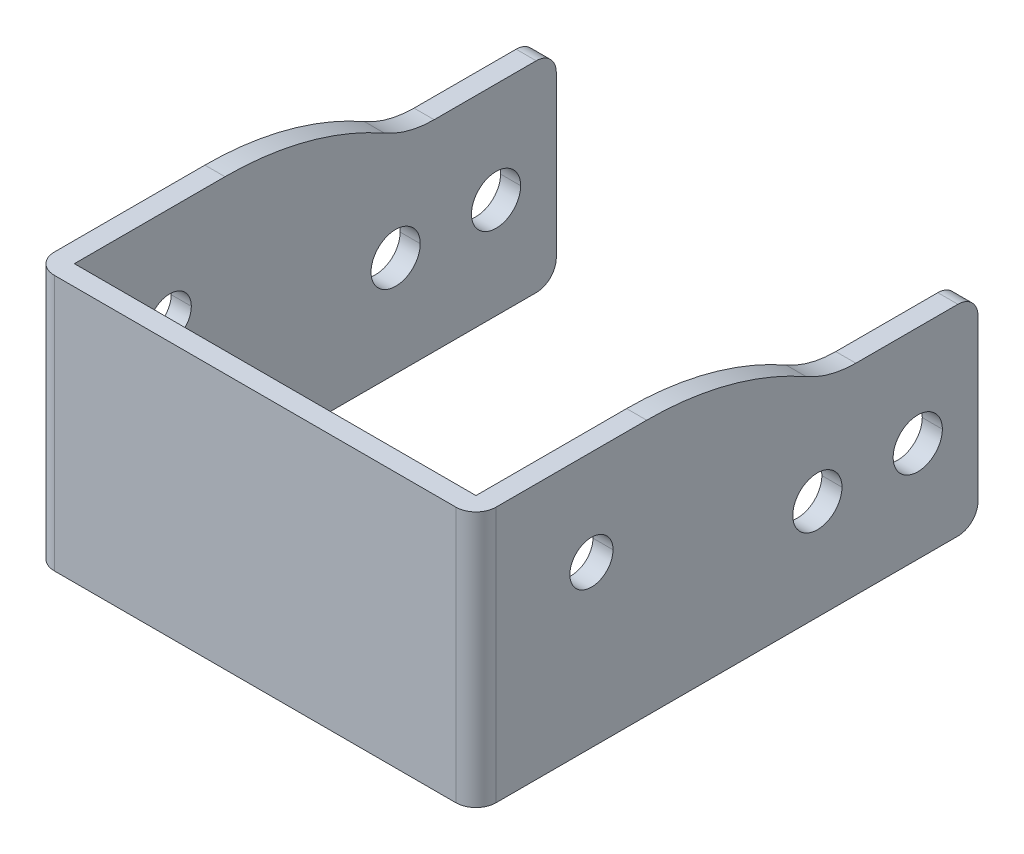
ISO-10303-21;
HEADER;
FILE_DESCRIPTION(('STEP AP214'),'2;1');
FILE_NAME('part.step','',(''),(''),'','','');
FILE_SCHEMA(('AUTOMOTIVE_DESIGN { 1 0 10303 214 1 1 1 1 }'));
ENDSEC;
DATA;
#1=APPLICATION_CONTEXT('core data for automotive mechanical design processes');
#2=APPLICATION_PROTOCOL_DEFINITION('international standard','automotive_design',2000,#1);
#3=PRODUCT_CONTEXT('',#1,'mechanical');
#4=PRODUCT('Part','Part','',(#3));
#5=PRODUCT_RELATED_PRODUCT_CATEGORY('part','',(#4));
#6=PRODUCT_DEFINITION_FORMATION('','',#4);
#7=PRODUCT_DEFINITION_CONTEXT('part definition',#1,'design');
#8=PRODUCT_DEFINITION('design','',#6,#7);
#9=PRODUCT_DEFINITION_SHAPE('','',#8);
#10=(LENGTH_UNIT() NAMED_UNIT(*) SI_UNIT(.MILLI.,.METRE.));
#11=(NAMED_UNIT(*) PLANE_ANGLE_UNIT() SI_UNIT($,.RADIAN.));
#12=(NAMED_UNIT(*) SI_UNIT($,.STERADIAN.) SOLID_ANGLE_UNIT());
#13=UNCERTAINTY_MEASURE_WITH_UNIT(LENGTH_MEASURE(1.E-05),#10,'distance_accuracy_value','');
#14=(GEOMETRIC_REPRESENTATION_CONTEXT(3) GLOBAL_UNCERTAINTY_ASSIGNED_CONTEXT((#13)) GLOBAL_UNIT_ASSIGNED_CONTEXT((#10,
#11,#12)) REPRESENTATION_CONTEXT('',''));
#15=CARTESIAN_POINT('',(0.,0.,0.));
#16=DIRECTION('',(0.,0.,1.));
#17=DIRECTION('',(1.,0.,0.));
#18=AXIS2_PLACEMENT_3D('',#15,#16,#17);
#19=CARTESIAN_POINT('',(-22.,18.,-48.));
#20=DIRECTION('',(1.,0.,0.));
#21=DIRECTION('',(0.,0.,-1.));
#22=AXIS2_PLACEMENT_3D('',#19,#20,#21);
#23=CYLINDRICAL_SURFACE('',#22,2.);
#24=CARTESIAN_POINT('',(-22.,18.,-48.));
#25=DIRECTION('',(-1.,0.,0.));
#26=DIRECTION('',(0.,0.,-1.));
#27=AXIS2_PLACEMENT_3D('',#24,#25,#26);
#28=CIRCLE('',#27,2.);
#29=CARTESIAN_POINT('',(-22.,20.,-48.));
#30=VERTEX_POINT('',#29);
#31=CARTESIAN_POINT('',(-22.,18.,-50.));
#32=VERTEX_POINT('',#31);
#33=EDGE_CURVE('E350',#30,#32,#28,.T.);
#34=ORIENTED_EDGE('',*,*,#33,.F.);
#35=DIRECTION('',(-1.,0.,0.));
#36=VECTOR('',#35,1.);
#37=CARTESIAN_POINT('',(-22.,20.,-48.));
#38=LINE('',#37,#36);
#39=CARTESIAN_POINT('',(-20.,20.,-48.));
#40=VERTEX_POINT('',#39);
#41=EDGE_CURVE('E39',#40,#30,#38,.T.);
#42=ORIENTED_EDGE('',*,*,#41,.F.);
#43=CARTESIAN_POINT('',(-20.,18.,-48.));
#44=DIRECTION('',(1.,0.,0.));
#45=DIRECTION('',(0.,0.,1.));
#46=AXIS2_PLACEMENT_3D('',#43,#44,#45);
#47=CIRCLE('',#46,2.);
#48=CARTESIAN_POINT('',(-20.,18.,-50.));
#49=VERTEX_POINT('',#48);
#50=EDGE_CURVE('E433',#49,#40,#47,.T.);
#51=ORIENTED_EDGE('',*,*,#50,.F.);
#52=DIRECTION('',(1.,0.,0.));
#53=VECTOR('',#52,1.);
#54=CARTESIAN_POINT('',(-22.,18.,-50.));
#55=LINE('',#54,#53);
#56=EDGE_CURVE('E334',#32,#49,#55,.T.);
#57=ORIENTED_EDGE('',*,*,#56,.F.);
#58=EDGE_LOOP('',(#34,#42,#51,#57));
#59=FACE_BOUND('',#58,.T.);
#60=ADVANCED_FACE('F17',(#59),#23,.T.);
#61=CARTESIAN_POINT('',(22.,18.,-48.));
#62=DIRECTION('',(1.,0.,0.));
#63=DIRECTION('',(0.,0.,-1.));
#64=AXIS2_PLACEMENT_3D('',#61,#62,#63);
#65=CYLINDRICAL_SURFACE('',#64,2.);
#66=CARTESIAN_POINT('',(20.,18.,-48.));
#67=DIRECTION('',(-1.,0.,0.));
#68=DIRECTION('',(0.,0.,-1.));
#69=AXIS2_PLACEMENT_3D('',#66,#67,#68);
#70=CIRCLE('',#69,2.);
#71=CARTESIAN_POINT('',(20.,20.,-48.));
#72=VERTEX_POINT('',#71);
#73=CARTESIAN_POINT('',(20.,18.,-50.));
#74=VERTEX_POINT('',#73);
#75=EDGE_CURVE('E437',#72,#74,#70,.T.);
#76=ORIENTED_EDGE('',*,*,#75,.F.);
#77=DIRECTION('',(-1.,0.,0.));
#78=VECTOR('',#77,1.);
#79=CARTESIAN_POINT('',(-22.,20.,-48.));
#80=LINE('',#79,#78);
#81=CARTESIAN_POINT('',(22.,20.,-48.));
#82=VERTEX_POINT('',#81);
#83=EDGE_CURVE('E370',#82,#72,#80,.T.);
#84=ORIENTED_EDGE('',*,*,#83,.F.);
#85=CARTESIAN_POINT('',(22.,18.,-48.));
#86=DIRECTION('',(1.,0.,0.));
#87=DIRECTION('',(0.,0.,1.));
#88=AXIS2_PLACEMENT_3D('',#85,#86,#87);
#89=CIRCLE('',#88,2.);
#90=CARTESIAN_POINT('',(22.,18.,-50.));
#91=VERTEX_POINT('',#90);
#92=EDGE_CURVE('E1374',#91,#82,#89,.T.);
#93=ORIENTED_EDGE('',*,*,#92,.F.);
#94=DIRECTION('',(1.,0.,0.));
#95=VECTOR('',#94,1.);
#96=CARTESIAN_POINT('',(22.,18.,-50.));
#97=LINE('',#96,#95);
#98=EDGE_CURVE('E412',#74,#91,#97,.T.);
#99=ORIENTED_EDGE('',*,*,#98,.F.);
#100=EDGE_LOOP('',(#76,#84,#93,#99));
#101=FACE_BOUND('',#100,.T.);
#102=ADVANCED_FACE('F19',(#101),#65,.T.);
#103=CARTESIAN_POINT('',(22.,2.,-48.));
#104=DIRECTION('',(1.,0.,0.));
#105=DIRECTION('',(0.,0.,-1.));
#106=AXIS2_PLACEMENT_3D('',#103,#104,#105);
#107=CYLINDRICAL_SURFACE('',#106,2.);
#108=CARTESIAN_POINT('',(22.,2.,-48.));
#109=DIRECTION('',(1.,0.,0.));
#110=DIRECTION('',(0.,0.,1.));
#111=AXIS2_PLACEMENT_3D('',#108,#109,#110);
#112=CIRCLE('',#111,2.);
#113=CARTESIAN_POINT('',(22.,0.,-48.));
#114=VERTEX_POINT('',#113);
#115=CARTESIAN_POINT('',(22.,2.,-50.));
#116=VERTEX_POINT('',#115);
#117=EDGE_CURVE('E1366',#114,#116,#112,.T.);
#118=ORIENTED_EDGE('',*,*,#117,.F.);
#119=DIRECTION('',(1.,0.,0.));
#120=VECTOR('',#119,1.);
#121=CARTESIAN_POINT('',(22.,0.,-48.));
#122=LINE('',#121,#120);
#123=CARTESIAN_POINT('',(20.,0.,-48.));
#124=VERTEX_POINT('',#123);
#125=EDGE_CURVE('E364',#124,#114,#122,.T.);
#126=ORIENTED_EDGE('',*,*,#125,.F.);
#127=CARTESIAN_POINT('',(20.,2.,-48.));
#128=DIRECTION('',(-1.,0.,0.));
#129=DIRECTION('',(0.,0.,-1.));
#130=AXIS2_PLACEMENT_3D('',#127,#128,#129);
#131=CIRCLE('',#130,2.);
#132=CARTESIAN_POINT('',(20.,2.,-50.));
#133=VERTEX_POINT('',#132);
#134=EDGE_CURVE('E415',#133,#124,#131,.T.);
#135=ORIENTED_EDGE('',*,*,#134,.F.);
#136=DIRECTION('',(-1.,0.,0.));
#137=VECTOR('',#136,1.);
#138=CARTESIAN_POINT('',(20.,2.,-50.));
#139=LINE('',#138,#137);
#140=EDGE_CURVE('E403',#116,#133,#139,.T.);
#141=ORIENTED_EDGE('',*,*,#140,.F.);
#142=EDGE_LOOP('',(#118,#126,#135,#141));
#143=FACE_BOUND('',#142,.T.);
#144=ADVANCED_FACE('F1005',(#143),#107,.T.);
#145=CARTESIAN_POINT('',(-22.,2.,-48.));
#146=DIRECTION('',(1.,0.,0.));
#147=DIRECTION('',(0.,0.,-1.));
#148=AXIS2_PLACEMENT_3D('',#145,#146,#147);
#149=CYLINDRICAL_SURFACE('',#148,2.);
#150=CARTESIAN_POINT('',(-20.,2.,-48.));
#151=DIRECTION('',(1.,0.,0.));
#152=DIRECTION('',(0.,0.,1.));
#153=AXIS2_PLACEMENT_3D('',#150,#151,#152);
#154=CIRCLE('',#153,2.);
#155=CARTESIAN_POINT('',(-20.,0.,-48.));
#156=VERTEX_POINT('',#155);
#157=CARTESIAN_POINT('',(-20.,2.,-50.));
#158=VERTEX_POINT('',#157);
#159=EDGE_CURVE('E461',#156,#158,#154,.T.);
#160=ORIENTED_EDGE('',*,*,#159,.F.);
#161=DIRECTION('',(1.,0.,0.));
#162=VECTOR('',#161,1.);
#163=CARTESIAN_POINT('',(-20.,0.,-48.));
#164=LINE('',#163,#162);
#165=CARTESIAN_POINT('',(-22.,0.,-48.));
#166=VERTEX_POINT('',#165);
#167=EDGE_CURVE('E361',#166,#156,#164,.T.);
#168=ORIENTED_EDGE('',*,*,#167,.F.);
#169=CARTESIAN_POINT('',(-22.,2.,-48.));
#170=DIRECTION('',(-1.,0.,0.));
#171=DIRECTION('',(0.,0.,-1.));
#172=AXIS2_PLACEMENT_3D('',#169,#170,#171);
#173=CIRCLE('',#172,2.);
#174=CARTESIAN_POINT('',(-22.,2.,-50.));
#175=VERTEX_POINT('',#174);
#176=EDGE_CURVE('E353',#175,#166,#173,.T.);
#177=ORIENTED_EDGE('',*,*,#176,.F.);
#178=DIRECTION('',(-1.,0.,0.));
#179=VECTOR('',#178,1.);
#180=CARTESIAN_POINT('',(-22.,2.,-50.));
#181=LINE('',#180,#179);
#182=EDGE_CURVE('E399',#158,#175,#181,.T.);
#183=ORIENTED_EDGE('',*,*,#182,.F.);
#184=EDGE_LOOP('',(#160,#168,#177,#183));
#185=FACE_BOUND('',#184,.T.);
#186=ADVANCED_FACE('F505',(#185),#149,.T.);
#187=CARTESIAN_POINT('',(20.,25.5,-2.));
#188=DIRECTION('',(0.,-1.,0.));
#189=DIRECTION('',(0.,0.,-1.));
#190=AXIS2_PLACEMENT_3D('',#187,#188,#189);
#191=CYLINDRICAL_SURFACE('',#190,2.);
#192=CARTESIAN_POINT('',(20.,25.5,-2.));
#193=DIRECTION('',(0.,1.,0.));
#194=DIRECTION('',(0.,0.,-1.));
#195=AXIS2_PLACEMENT_3D('',#192,#193,#194);
#196=CIRCLE('',#195,2.);
#197=CARTESIAN_POINT('',(20.,25.5,0.));
#198=VERTEX_POINT('',#197);
#199=CARTESIAN_POINT('',(22.,25.5,-2.));
#200=VERTEX_POINT('',#199);
#201=EDGE_CURVE('E310',#198,#200,#196,.T.);
#202=ORIENTED_EDGE('',*,*,#201,.F.);
#203=DIRECTION('',(0.,1.,0.));
#204=VECTOR('',#203,1.);
#205=CARTESIAN_POINT('',(20.,25.5,0.));
#206=LINE('',#205,#204);
#207=CARTESIAN_POINT('',(20.,0.,0.));
#208=VERTEX_POINT('',#207);
#209=EDGE_CURVE('E1351',#208,#198,#206,.T.);
#210=ORIENTED_EDGE('',*,*,#209,.F.);
#211=CARTESIAN_POINT('',(20.,0.,-2.));
#212=DIRECTION('',(0.,-1.,0.));
#213=DIRECTION('',(0.,0.,-1.));
#214=AXIS2_PLACEMENT_3D('',#211,#212,#213);
#215=CIRCLE('',#214,2.);
#216=CARTESIAN_POINT('',(22.,0.,-2.));
#217=VERTEX_POINT('',#216);
#218=EDGE_CURVE('E367',#217,#208,#215,.T.);
#219=ORIENTED_EDGE('',*,*,#218,.F.);
#220=DIRECTION('',(0.,-1.,0.));
#221=VECTOR('',#220,1.);
#222=CARTESIAN_POINT('',(22.,25.5,-2.));
#223=LINE('',#222,#221);
#224=EDGE_CURVE('E1360',#200,#217,#223,.T.);
#225=ORIENTED_EDGE('',*,*,#224,.F.);
#226=EDGE_LOOP('',(#202,#210,#219,#225));
#227=FACE_BOUND('',#226,.T.);
#228=ADVANCED_FACE('F989',(#227),#191,.T.);
#229=CARTESIAN_POINT('',(-20.,25.5,-2.));
#230=DIRECTION('',(0.,-1.,0.));
#231=DIRECTION('',(0.,0.,-1.));
#232=AXIS2_PLACEMENT_3D('',#229,#230,#231);
#233=CYLINDRICAL_SURFACE('',#232,2.);
#234=CARTESIAN_POINT('',(-20.,25.5,-2.));
#235=DIRECTION('',(0.,1.,0.));
#236=DIRECTION('',(0.,0.,-1.));
#237=AXIS2_PLACEMENT_3D('',#234,#235,#236);
#238=CIRCLE('',#237,2.);
#239=CARTESIAN_POINT('',(-22.,25.5,-2.));
#240=VERTEX_POINT('',#239);
#241=CARTESIAN_POINT('',(-20.,25.5,0.));
#242=VERTEX_POINT('',#241);
#243=EDGE_CURVE('E298',#240,#242,#238,.T.);
#244=ORIENTED_EDGE('',*,*,#243,.F.);
#245=DIRECTION('',(0.,1.,0.));
#246=VECTOR('',#245,1.);
#247=CARTESIAN_POINT('',(-22.,25.5,-2.));
#248=LINE('',#247,#246);
#249=CARTESIAN_POINT('',(-22.,0.,-2.));
#250=VERTEX_POINT('',#249);
#251=EDGE_CURVE('E302',#250,#240,#248,.T.);
#252=ORIENTED_EDGE('',*,*,#251,.F.);
#253=CARTESIAN_POINT('',(-20.,0.,-2.));
#254=DIRECTION('',(0.,-1.,0.));
#255=DIRECTION('',(0.,0.,-1.));
#256=AXIS2_PLACEMENT_3D('',#253,#254,#255);
#257=CIRCLE('',#256,2.);
#258=CARTESIAN_POINT('',(-20.,0.,0.));
#259=VERTEX_POINT('',#258);
#260=EDGE_CURVE('E348',#259,#250,#257,.T.);
#261=ORIENTED_EDGE('',*,*,#260,.F.);
#262=DIRECTION('',(0.,-1.,0.));
#263=VECTOR('',#262,1.);
#264=CARTESIAN_POINT('',(-20.,25.5,0.));
#265=LINE('',#264,#263);
#266=EDGE_CURVE('E305',#242,#259,#265,.T.);
#267=ORIENTED_EDGE('',*,*,#266,.F.);
#268=EDGE_LOOP('',(#244,#252,#261,#267));
#269=FACE_BOUND('',#268,.T.);
#270=ADVANCED_FACE('F300',(#269),#233,.T.);
#271=CARTESIAN_POINT('',(-22.,30.,-37.8328555255092));
#272=DIRECTION('',(1.,0.,0.));
#273=DIRECTION('',(0.,0.,-1.));
#274=AXIS2_PLACEMENT_3D('',#271,#272,#273);
#275=CYLINDRICAL_SURFACE('',#274,10.);
#276=CARTESIAN_POINT('',(-22.,30.,-37.8328555255092));
#277=DIRECTION('',(1.,0.,0.));
#278=DIRECTION('',(0.,0.,-1.));
#279=AXIS2_PLACEMENT_3D('',#276,#277,#278);
#280=CIRCLE('',#279,10.);
#281=CARTESIAN_POINT('',(-22.,21.303317535545,-32.8964890366389));
#282=VERTEX_POINT('',#281);
#283=CARTESIAN_POINT('',(-22.,20.,-37.8328555255092));
#284=VERTEX_POINT('',#283);
#285=EDGE_CURVE('E341',#282,#284,#280,.T.);
#286=ORIENTED_EDGE('',*,*,#285,.F.);
#287=DIRECTION('',(-1.,0.,0.));
#288=VECTOR('',#287,1.);
#289=CARTESIAN_POINT('',(-22.,21.303317535545,-32.8964890366389));
#290=LINE('',#289,#288);
#291=CARTESIAN_POINT('',(-20.,21.303317535545,-32.8964890366389));
#292=VERTEX_POINT('',#291);
#293=EDGE_CURVE('E26',#292,#282,#290,.T.);
#294=ORIENTED_EDGE('',*,*,#293,.F.);
#295=CARTESIAN_POINT('',(-20.,30.,-37.8328555255092));
#296=DIRECTION('',(-1.,0.,0.));
#297=DIRECTION('',(0.,0.,1.));
#298=AXIS2_PLACEMENT_3D('',#295,#296,#297);
#299=CIRCLE('',#298,10.);
#300=CARTESIAN_POINT('',(-20.,20.,-37.8328555255092));
#301=VERTEX_POINT('',#300);
#302=EDGE_CURVE('E432',#301,#292,#299,.T.);
#303=ORIENTED_EDGE('',*,*,#302,.F.);
#304=DIRECTION('',(1.,0.,0.));
#305=VECTOR('',#304,1.);
#306=CARTESIAN_POINT('',(-22.,20.,-37.8328555255092));
#307=LINE('',#306,#305);
#308=EDGE_CURVE('E53',#284,#301,#307,.T.);
#309=ORIENTED_EDGE('',*,*,#308,.F.);
#310=EDGE_LOOP('',(#286,#294,#303,#309));
#311=FACE_BOUND('',#310,.T.);
#312=ADVANCED_FACE('F973',(#311),#275,.F.);
#313=CARTESIAN_POINT('',(-22.,30.,-37.8328555255092));
#314=DIRECTION('',(1.,0.,0.));
#315=DIRECTION('',(0.,0.,-1.));
#316=AXIS2_PLACEMENT_3D('',#313,#314,#315);
#317=CYLINDRICAL_SURFACE('',#316,10.);
#318=CARTESIAN_POINT('',(20.,30.,-37.8328555255092));
#319=DIRECTION('',(1.,0.,0.));
#320=DIRECTION('',(0.,0.,-1.));
#321=AXIS2_PLACEMENT_3D('',#318,#319,#320);
#322=CIRCLE('',#321,10.);
#323=CARTESIAN_POINT('',(20.,21.303317535545,-32.8964890366389));
#324=VERTEX_POINT('',#323);
#325=CARTESIAN_POINT('',(20.,20.,-37.8328555255092));
#326=VERTEX_POINT('',#325);
#327=EDGE_CURVE('E422',#324,#326,#322,.T.);
#328=ORIENTED_EDGE('',*,*,#327,.F.);
#329=DIRECTION('',(-1.,0.,0.));
#330=VECTOR('',#329,1.);
#331=CARTESIAN_POINT('',(-22.,21.303317535545,-32.8964890366389));
#332=LINE('',#331,#330);
#333=CARTESIAN_POINT('',(22.,21.303317535545,-32.8964890366389));
#334=VERTEX_POINT('',#333);
#335=EDGE_CURVE('E11',#334,#324,#332,.T.);
#336=ORIENTED_EDGE('',*,*,#335,.F.);
#337=CARTESIAN_POINT('',(22.,30.,-37.8328555255092));
#338=DIRECTION('',(-1.,0.,0.));
#339=DIRECTION('',(0.,0.,1.));
#340=AXIS2_PLACEMENT_3D('',#337,#338,#339);
#341=CIRCLE('',#340,10.);
#342=CARTESIAN_POINT('',(22.,20.,-37.8328555255092));
#343=VERTEX_POINT('',#342);
#344=EDGE_CURVE('E388',#343,#334,#341,.T.);
#345=ORIENTED_EDGE('',*,*,#344,.F.);
#346=DIRECTION('',(1.,0.,0.));
#347=VECTOR('',#346,1.);
#348=CARTESIAN_POINT('',(-22.,20.,-37.8328555255092));
#349=LINE('',#348,#347);
#350=EDGE_CURVE('E372',#326,#343,#349,.T.);
#351=ORIENTED_EDGE('',*,*,#350,.F.);
#352=EDGE_LOOP('',(#328,#336,#345,#351));
#353=FACE_BOUND('',#352,.T.);
#354=ADVANCED_FACE('F964',(#353),#317,.F.);
#355=CARTESIAN_POINT('',(-22.,-6.7,-17.0013889424767));
#356=DIRECTION('',(1.,0.,0.));
#357=DIRECTION('',(0.,0.,-1.));
#358=AXIS2_PLACEMENT_3D('',#355,#356,#357);
#359=CYLINDRICAL_SURFACE('',#358,32.2);
#360=CARTESIAN_POINT('',(22.,-6.7,-17.0013889424767));
#361=DIRECTION('',(1.,0.,0.));
#362=DIRECTION('',(0.,0.,1.));
#363=AXIS2_PLACEMENT_3D('',#360,#361,#362);
#364=CIRCLE('',#363,32.2);
#365=CARTESIAN_POINT('',(22.,25.5,-17.0013889424767));
#366=VERTEX_POINT('',#365);
#367=EDGE_CURVE('E390',#334,#366,#364,.T.);
#368=ORIENTED_EDGE('',*,*,#367,.F.);
#369=ORIENTED_EDGE('',*,*,#335,.T.);
#370=CARTESIAN_POINT('',(20.,-6.7,-17.0013889424767));
#371=DIRECTION('',(-1.,0.,0.));
#372=DIRECTION('',(0.,0.,-1.));
#373=AXIS2_PLACEMENT_3D('',#370,#371,#372);
#374=CIRCLE('',#373,32.2);
#375=CARTESIAN_POINT('',(20.,25.5,-17.0013889424767));
#376=VERTEX_POINT('',#375);
#377=EDGE_CURVE('E427',#376,#324,#374,.T.);
#378=ORIENTED_EDGE('',*,*,#377,.F.);
#379=DIRECTION('',(-1.,0.,0.));
#380=VECTOR('',#379,1.);
#381=CARTESIAN_POINT('',(0.,25.5,-17.0013889424767));
#382=LINE('',#381,#380);
#383=EDGE_CURVE('E349',#366,#376,#382,.T.);
#384=ORIENTED_EDGE('',*,*,#383,.F.);
#385=EDGE_LOOP('',(#368,#369,#378,#384));
#386=FACE_BOUND('',#385,.T.);
#387=ADVANCED_FACE('F956',(#386),#359,.T.);
#388=CARTESIAN_POINT('',(-22.,-6.7,-17.0013889424767));
#389=DIRECTION('',(1.,0.,0.));
#390=DIRECTION('',(0.,0.,-1.));
#391=AXIS2_PLACEMENT_3D('',#388,#389,#390);
#392=CYLINDRICAL_SURFACE('',#391,32.2);
#393=CARTESIAN_POINT('',(-20.,-6.7,-17.0013889424767));
#394=DIRECTION('',(1.,0.,0.));
#395=DIRECTION('',(0.,0.,1.));
#396=AXIS2_PLACEMENT_3D('',#393,#394,#395);
#397=CIRCLE('',#396,32.2);
#398=CARTESIAN_POINT('',(-20.,25.5,-17.0013889424767));
#399=VERTEX_POINT('',#398);
#400=EDGE_CURVE('E472',#292,#399,#397,.T.);
#401=ORIENTED_EDGE('',*,*,#400,.F.);
#402=ORIENTED_EDGE('',*,*,#293,.T.);
#403=CARTESIAN_POINT('',(-22.,-6.7,-17.0013889424767));
#404=DIRECTION('',(-1.,0.,0.));
#405=DIRECTION('',(0.,0.,-1.));
#406=AXIS2_PLACEMENT_3D('',#403,#404,#405);
#407=CIRCLE('',#406,32.2);
#408=CARTESIAN_POINT('',(-22.,25.5,-17.0013889424767));
#409=VERTEX_POINT('',#408);
#410=EDGE_CURVE('E322',#409,#282,#407,.T.);
#411=ORIENTED_EDGE('',*,*,#410,.F.);
#412=DIRECTION('',(-1.,0.,0.));
#413=VECTOR('',#412,1.);
#414=CARTESIAN_POINT('',(0.,25.5,-17.0013889424767));
#415=LINE('',#414,#413);
#416=EDGE_CURVE('E317',#399,#409,#415,.T.);
#417=ORIENTED_EDGE('',*,*,#416,.F.);
#418=EDGE_LOOP('',(#401,#402,#411,#417));
#419=FACE_BOUND('',#418,.T.);
#420=ADVANCED_FACE('F948',(#419),#392,.T.);
#421=CARTESIAN_POINT('',(-22.,20.,-50.));
#422=DIRECTION('',(0.,-1.,0.));
#423=DIRECTION('',(0.,0.,-1.));
#424=AXIS2_PLACEMENT_3D('',#421,#422,#423);
#425=PLANE('',#424);
#426=DIRECTION('',(0.,0.,-1.));
#427=VECTOR('',#426,1.);
#428=CARTESIAN_POINT('',(22.,20.,-50.));
#429=LINE('',#428,#427);
#430=EDGE_CURVE('E1379',#343,#82,#429,.T.);
#431=ORIENTED_EDGE('',*,*,#430,.T.);
#432=ORIENTED_EDGE('',*,*,#83,.T.);
#433=DIRECTION('',(0.,0.,-1.));
#434=VECTOR('',#433,1.);
#435=CARTESIAN_POINT('',(20.,20.,-2.));
#436=LINE('',#435,#434);
#437=EDGE_CURVE('E426',#326,#72,#436,.T.);
#438=ORIENTED_EDGE('',*,*,#437,.F.);
#439=ORIENTED_EDGE('',*,*,#350,.T.);
#440=EDGE_LOOP('',(#431,#432,#438,#439));
#441=FACE_BOUND('',#440,.T.);
#442=ADVANCED_FACE('F933',(#441),#425,.F.);
#443=CARTESIAN_POINT('',(-22.,20.,-50.));
#444=DIRECTION('',(0.,-1.,0.));
#445=DIRECTION('',(0.,0.,-1.));
#446=AXIS2_PLACEMENT_3D('',#443,#444,#445);
#447=PLANE('',#446);
#448=DIRECTION('',(0.,0.,1.));
#449=VECTOR('',#448,1.);
#450=CARTESIAN_POINT('',(-20.,20.,-2.));
#451=LINE('',#450,#449);
#452=EDGE_CURVE('E428',#40,#301,#451,.T.);
#453=ORIENTED_EDGE('',*,*,#452,.F.);
#454=ORIENTED_EDGE('',*,*,#41,.T.);
#455=DIRECTION('',(0.,0.,-1.));
#456=VECTOR('',#455,1.);
#457=CARTESIAN_POINT('',(-22.,20.,-50.));
#458=LINE('',#457,#456);
#459=EDGE_CURVE('E345',#284,#30,#458,.T.);
#460=ORIENTED_EDGE('',*,*,#459,.F.);
#461=ORIENTED_EDGE('',*,*,#308,.T.);
#462=EDGE_LOOP('',(#453,#454,#460,#461));
#463=FACE_BOUND('',#462,.T.);
#464=ADVANCED_FACE('F924',(#463),#447,.F.);
#465=CARTESIAN_POINT('',(-22.,10.,-44.));
#466=DIRECTION('',(1.,0.,0.));
#467=DIRECTION('',(0.,0.,-1.));
#468=AXIS2_PLACEMENT_3D('',#465,#466,#467);
#469=CYLINDRICAL_SURFACE('',#468,2.45);
#470=DIRECTION('',(1.,0.,0.));
#471=VECTOR('',#470,1.);
#472=CARTESIAN_POINT('',(-22.,10.,-41.55));
#473=LINE('',#472,#471);
#474=CARTESIAN_POINT('',(20.,10.,-41.55));
#475=VERTEX_POINT('',#474);
#476=CARTESIAN_POINT('',(22.,10.,-41.55));
#477=VERTEX_POINT('',#476);
#478=EDGE_CURVE('E1409',#475,#477,#473,.T.);
#479=ORIENTED_EDGE('',*,*,#478,.F.);
#480=CARTESIAN_POINT('',(20.,10.,-44.));
#481=DIRECTION('',(1.,0.,0.));
#482=DIRECTION('',(0.,0.,-1.));
#483=AXIS2_PLACEMENT_3D('',#480,#481,#482);
#484=CIRCLE('',#483,2.45);
#485=CARTESIAN_POINT('',(20.,10.,-46.45));
#486=VERTEX_POINT('',#485);
#487=EDGE_CURVE('E440',#486,#475,#484,.T.);
#488=ORIENTED_EDGE('',*,*,#487,.F.);
#489=DIRECTION('',(1.,0.,0.));
#490=VECTOR('',#489,1.);
#491=CARTESIAN_POINT('',(-22.,10.,-46.45));
#492=LINE('',#491,#490);
#493=CARTESIAN_POINT('',(22.,10.,-46.45));
#494=VERTEX_POINT('',#493);
#495=EDGE_CURVE('E1420',#486,#494,#492,.T.);
#496=ORIENTED_EDGE('',*,*,#495,.T.);
#497=CARTESIAN_POINT('',(22.,10.,-44.));
#498=DIRECTION('',(1.,0.,0.));
#499=DIRECTION('',(0.,0.,-1.));
#500=AXIS2_PLACEMENT_3D('',#497,#498,#499);
#501=CIRCLE('',#500,2.45);
#502=EDGE_CURVE('E394',#494,#477,#501,.T.);
#503=ORIENTED_EDGE('',*,*,#502,.T.);
#504=EDGE_LOOP('',(#479,#488,#496,#503));
#505=FACE_BOUND('',#504,.T.);
#506=ADVANCED_FACE('F915',(#505),#469,.F.);
#507=CARTESIAN_POINT('',(-22.,10.,-34.));
#508=DIRECTION('',(1.,0.,0.));
#509=DIRECTION('',(0.,0.,-1.));
#510=AXIS2_PLACEMENT_3D('',#507,#508,#509);
#511=CYLINDRICAL_SURFACE('',#510,2.45);
#512=DIRECTION('',(1.,0.,0.));
#513=VECTOR('',#512,1.);
#514=CARTESIAN_POINT('',(-22.,10.,-31.55));
#515=LINE('',#514,#513);
#516=CARTESIAN_POINT('',(20.,10.,-31.55));
#517=VERTEX_POINT('',#516);
#518=CARTESIAN_POINT('',(22.,10.,-31.55));
#519=VERTEX_POINT('',#518);
#520=EDGE_CURVE('E1429',#517,#519,#515,.T.);
#521=ORIENTED_EDGE('',*,*,#520,.F.);
#522=CARTESIAN_POINT('',(20.,10.,-34.));
#523=DIRECTION('',(1.,0.,0.));
#524=DIRECTION('',(0.,0.,-1.));
#525=AXIS2_PLACEMENT_3D('',#522,#523,#524);
#526=CIRCLE('',#525,2.45);
#527=CARTESIAN_POINT('',(20.,10.,-36.45));
#528=VERTEX_POINT('',#527);
#529=EDGE_CURVE('E441',#528,#517,#526,.T.);
#530=ORIENTED_EDGE('',*,*,#529,.F.);
#531=DIRECTION('',(1.,0.,0.));
#532=VECTOR('',#531,1.);
#533=CARTESIAN_POINT('',(-22.,10.,-36.45));
#534=LINE('',#533,#532);
#535=CARTESIAN_POINT('',(22.,10.,-36.45));
#536=VERTEX_POINT('',#535);
#537=EDGE_CURVE('E1289',#528,#536,#534,.T.);
#538=ORIENTED_EDGE('',*,*,#537,.T.);
#539=CARTESIAN_POINT('',(22.,10.,-34.));
#540=DIRECTION('',(1.,0.,0.));
#541=DIRECTION('',(0.,0.,-1.));
#542=AXIS2_PLACEMENT_3D('',#539,#540,#541);
#543=CIRCLE('',#542,2.45);
#544=EDGE_CURVE('E402',#536,#519,#543,.T.);
#545=ORIENTED_EDGE('',*,*,#544,.T.);
#546=EDGE_LOOP('',(#521,#530,#538,#545));
#547=FACE_BOUND('',#546,.T.);
#548=ADVANCED_FACE('F906',(#547),#511,.F.);
#549=CARTESIAN_POINT('',(-22.,16.,-11.5));
#550=DIRECTION('',(1.,0.,0.));
#551=DIRECTION('',(0.,0.,-1.));
#552=AXIS2_PLACEMENT_3D('',#549,#550,#551);
#553=CYLINDRICAL_SURFACE('',#552,2.15);
#554=DIRECTION('',(1.,0.,0.));
#555=VECTOR('',#554,1.);
#556=CARTESIAN_POINT('',(-22.,16.,-9.35));
#557=LINE('',#556,#555);
#558=CARTESIAN_POINT('',(20.,16.,-9.35));
#559=VERTEX_POINT('',#558);
#560=CARTESIAN_POINT('',(22.,16.,-9.35));
#561=VERTEX_POINT('',#560);
#562=EDGE_CURVE('E1272',#559,#561,#557,.T.);
#563=ORIENTED_EDGE('',*,*,#562,.F.);
#564=CARTESIAN_POINT('',(20.,16.,-11.5));
#565=DIRECTION('',(1.,0.,0.));
#566=DIRECTION('',(0.,0.,-1.));
#567=AXIS2_PLACEMENT_3D('',#564,#565,#566);
#568=CIRCLE('',#567,2.15);
#569=CARTESIAN_POINT('',(20.,16.,-13.65));
#570=VERTEX_POINT('',#569);
#571=EDGE_CURVE('E444',#570,#559,#568,.T.);
#572=ORIENTED_EDGE('',*,*,#571,.F.);
#573=DIRECTION('',(1.,0.,0.));
#574=VECTOR('',#573,1.);
#575=CARTESIAN_POINT('',(-22.,16.,-13.65));
#576=LINE('',#575,#574);
#577=CARTESIAN_POINT('',(22.,16.,-13.65));
#578=VERTEX_POINT('',#577);
#579=EDGE_CURVE('E1275',#570,#578,#576,.T.);
#580=ORIENTED_EDGE('',*,*,#579,.T.);
#581=CARTESIAN_POINT('',(22.,16.,-11.5));
#582=DIRECTION('',(1.,0.,0.));
#583=DIRECTION('',(0.,0.,-1.));
#584=AXIS2_PLACEMENT_3D('',#581,#582,#583);
#585=CIRCLE('',#584,2.15);
#586=EDGE_CURVE('E408',#578,#561,#585,.T.);
#587=ORIENTED_EDGE('',*,*,#586,.T.);
#588=EDGE_LOOP('',(#563,#572,#580,#587));
#589=FACE_BOUND('',#588,.T.);
#590=ADVANCED_FACE('F840',(#589),#553,.F.);
#591=CARTESIAN_POINT('',(-22.,10.,-44.));
#592=DIRECTION('',(1.,0.,0.));
#593=DIRECTION('',(0.,0.,-1.));
#594=AXIS2_PLACEMENT_3D('',#591,#592,#593);
#595=CYLINDRICAL_SURFACE('',#594,2.45);
#596=DIRECTION('',(1.,0.,0.));
#597=VECTOR('',#596,1.);
#598=CARTESIAN_POINT('',(-22.,10.,-41.55));
#599=LINE('',#598,#597);
#600=CARTESIAN_POINT('',(-22.,10.,-41.55));
#601=VERTEX_POINT('',#600);
#602=CARTESIAN_POINT('',(-20.,10.,-41.55));
#603=VERTEX_POINT('',#602);
#604=EDGE_CURVE('E1300',#601,#603,#599,.T.);
#605=ORIENTED_EDGE('',*,*,#604,.F.);
#606=CARTESIAN_POINT('',(-22.,10.,-44.));
#607=DIRECTION('',(1.,0.,0.));
#608=DIRECTION('',(0.,0.,-1.));
#609=AXIS2_PLACEMENT_3D('',#606,#607,#608);
#610=CIRCLE('',#609,2.45);
#611=CARTESIAN_POINT('',(-22.,10.,-46.45));
#612=VERTEX_POINT('',#611);
#613=EDGE_CURVE('E490',#612,#601,#610,.T.);
#614=ORIENTED_EDGE('',*,*,#613,.F.);
#615=DIRECTION('',(1.,0.,0.));
#616=VECTOR('',#615,1.);
#617=CARTESIAN_POINT('',(-22.,10.,-46.45));
#618=LINE('',#617,#616);
#619=CARTESIAN_POINT('',(-20.,10.,-46.45));
#620=VERTEX_POINT('',#619);
#621=EDGE_CURVE('E1311',#612,#620,#618,.T.);
#622=ORIENTED_EDGE('',*,*,#621,.T.);
#623=CARTESIAN_POINT('',(-20.,10.,-44.));
#624=DIRECTION('',(-1.,0.,0.));
#625=DIRECTION('',(0.,0.,1.));
#626=AXIS2_PLACEMENT_3D('',#623,#624,#625);
#627=CIRCLE('',#626,2.45);
#628=EDGE_CURVE('E471',#603,#620,#627,.T.);
#629=ORIENTED_EDGE('',*,*,#628,.F.);
#630=EDGE_LOOP('',(#605,#614,#622,#629));
#631=FACE_BOUND('',#630,.T.);
#632=ADVANCED_FACE('F835',(#631),#595,.F.);
#633=CARTESIAN_POINT('',(-22.,10.,-34.));
#634=DIRECTION('',(1.,0.,0.));
#635=DIRECTION('',(0.,0.,-1.));
#636=AXIS2_PLACEMENT_3D('',#633,#634,#635);
#637=CYLINDRICAL_SURFACE('',#636,2.45);
#638=DIRECTION('',(1.,0.,0.));
#639=VECTOR('',#638,1.);
#640=CARTESIAN_POINT('',(-22.,10.,-31.55));
#641=LINE('',#640,#639);
#642=CARTESIAN_POINT('',(-22.,10.,-31.55));
#643=VERTEX_POINT('',#642);
#644=CARTESIAN_POINT('',(-20.,10.,-31.55));
#645=VERTEX_POINT('',#644);
#646=EDGE_CURVE('E1316',#643,#645,#641,.T.);
#647=ORIENTED_EDGE('',*,*,#646,.F.);
#648=CARTESIAN_POINT('',(-22.,10.,-34.));
#649=DIRECTION('',(1.,0.,0.));
#650=DIRECTION('',(0.,0.,-1.));
#651=AXIS2_PLACEMENT_3D('',#648,#649,#650);
#652=CIRCLE('',#651,2.45);
#653=CARTESIAN_POINT('',(-22.,10.,-36.45));
#654=VERTEX_POINT('',#653);
#655=EDGE_CURVE('E355',#654,#643,#652,.T.);
#656=ORIENTED_EDGE('',*,*,#655,.F.);
#657=DIRECTION('',(1.,0.,0.));
#658=VECTOR('',#657,1.);
#659=CARTESIAN_POINT('',(-22.,10.,-36.45));
#660=LINE('',#659,#658);
#661=CARTESIAN_POINT('',(-20.,10.,-36.45));
#662=VERTEX_POINT('',#661);
#663=EDGE_CURVE('E1325',#654,#662,#660,.T.);
#664=ORIENTED_EDGE('',*,*,#663,.T.);
#665=CARTESIAN_POINT('',(-20.,10.,-34.));
#666=DIRECTION('',(-1.,0.,0.));
#667=DIRECTION('',(0.,0.,1.));
#668=AXIS2_PLACEMENT_3D('',#665,#666,#667);
#669=CIRCLE('',#668,2.45);
#670=EDGE_CURVE('E487',#645,#662,#669,.T.);
#671=ORIENTED_EDGE('',*,*,#670,.F.);
#672=EDGE_LOOP('',(#647,#656,#664,#671));
#673=FACE_BOUND('',#672,.T.);
#674=ADVANCED_FACE('F839',(#673),#637,.F.);
#675=CARTESIAN_POINT('',(-22.,16.,-11.5));
#676=DIRECTION('',(1.,0.,0.));
#677=DIRECTION('',(0.,0.,-1.));
#678=AXIS2_PLACEMENT_3D('',#675,#676,#677);
#679=CYLINDRICAL_SURFACE('',#678,2.15);
#680=DIRECTION('',(1.,0.,0.));
#681=VECTOR('',#680,1.);
#682=CARTESIAN_POINT('',(-22.,16.,-9.35));
#683=LINE('',#682,#681);
#684=CARTESIAN_POINT('',(-22.,16.,-9.35));
#685=VERTEX_POINT('',#684);
#686=CARTESIAN_POINT('',(-20.,16.,-9.35));
#687=VERTEX_POINT('',#686);
#688=EDGE_CURVE('E1332',#685,#687,#683,.T.);
#689=ORIENTED_EDGE('',*,*,#688,.F.);
#690=CARTESIAN_POINT('',(-22.,16.,-11.5));
#691=DIRECTION('',(1.,0.,0.));
#692=DIRECTION('',(0.,0.,-1.));
#693=AXIS2_PLACEMENT_3D('',#690,#691,#692);
#694=CIRCLE('',#693,2.15);
#695=CARTESIAN_POINT('',(-22.,16.,-13.65));
#696=VERTEX_POINT('',#695);
#697=EDGE_CURVE('E311',#696,#685,#694,.T.);
#698=ORIENTED_EDGE('',*,*,#697,.F.);
#699=DIRECTION('',(1.,0.,0.));
#700=VECTOR('',#699,1.);
#701=CARTESIAN_POINT('',(-22.,16.,-13.65));
#702=LINE('',#701,#700);
#703=CARTESIAN_POINT('',(-20.,16.,-13.65));
#704=VERTEX_POINT('',#703);
#705=EDGE_CURVE('E1299',#696,#704,#702,.T.);
#706=ORIENTED_EDGE('',*,*,#705,.T.);
#707=CARTESIAN_POINT('',(-20.,16.,-11.5));
#708=DIRECTION('',(-1.,0.,0.));
#709=DIRECTION('',(0.,0.,1.));
#710=AXIS2_PLACEMENT_3D('',#707,#708,#709);
#711=CIRCLE('',#710,2.15);
#712=EDGE_CURVE('E493',#687,#704,#711,.T.);
#713=ORIENTED_EDGE('',*,*,#712,.F.);
#714=EDGE_LOOP('',(#689,#698,#706,#713));
#715=FACE_BOUND('',#714,.T.);
#716=ADVANCED_FACE('F870',(#715),#679,.F.);
#717=CARTESIAN_POINT('',(0.,0.,0.));
#718=DIRECTION('',(0.,-1.,0.));
#719=DIRECTION('',(0.,0.,-1.));
#720=AXIS2_PLACEMENT_3D('',#717,#718,#719);
#721=PLANE('',#720);
#722=DIRECTION('',(1.,0.,0.));
#723=VECTOR('',#722,1.);
#724=CARTESIAN_POINT('',(-22.,0.,0.));
#725=LINE('',#724,#723);
#726=EDGE_CURVE('E1347',#259,#208,#725,.T.);
#727=ORIENTED_EDGE('',*,*,#726,.F.);
#728=ORIENTED_EDGE('',*,*,#260,.T.);
#729=DIRECTION('',(0.,0.,1.));
#730=VECTOR('',#729,1.);
#731=CARTESIAN_POINT('',(-22.,0.,-2.));
#732=LINE('',#731,#730);
#733=EDGE_CURVE('E327',#166,#250,#732,.T.);
#734=ORIENTED_EDGE('',*,*,#733,.F.);
#735=ORIENTED_EDGE('',*,*,#167,.T.);
#736=DIRECTION('',(0.,0.,-1.));
#737=VECTOR('',#736,1.);
#738=CARTESIAN_POINT('',(-20.,0.,-2.));
#739=LINE('',#738,#737);
#740=CARTESIAN_POINT('',(-20.,0.,-2.));
#741=VERTEX_POINT('',#740);
#742=EDGE_CURVE('E457',#741,#156,#739,.T.);
#743=ORIENTED_EDGE('',*,*,#742,.F.);
#744=DIRECTION('',(-1.,0.,0.));
#745=VECTOR('',#744,1.);
#746=CARTESIAN_POINT('',(-20.,0.,-2.));
#747=LINE('',#746,#745);
#748=CARTESIAN_POINT('',(20.,0.,-2.));
#749=VERTEX_POINT('',#748);
#750=EDGE_CURVE('E445',#749,#741,#747,.T.);
#751=ORIENTED_EDGE('',*,*,#750,.F.);
#752=DIRECTION('',(0.,0.,1.));
#753=VECTOR('',#752,1.);
#754=CARTESIAN_POINT('',(20.,0.,-2.));
#755=LINE('',#754,#753);
#756=EDGE_CURVE('E421',#124,#749,#755,.T.);
#757=ORIENTED_EDGE('',*,*,#756,.F.);
#758=ORIENTED_EDGE('',*,*,#125,.T.);
#759=DIRECTION('',(0.,0.,-1.));
#760=VECTOR('',#759,1.);
#761=CARTESIAN_POINT('',(22.,0.,-2.));
#762=LINE('',#761,#760);
#763=EDGE_CURVE('E1362',#217,#114,#762,.T.);
#764=ORIENTED_EDGE('',*,*,#763,.F.);
#765=ORIENTED_EDGE('',*,*,#218,.T.);
#766=EDGE_LOOP('',(#727,#728,#734,#735,#743,#751,#757,#758,#764,#765));
#767=FACE_BOUND('',#766,.T.);
#768=ADVANCED_FACE('F874',(#767),#721,.T.);
#769=CARTESIAN_POINT('',(0.,25.5,0.));
#770=DIRECTION('',(0.,-1.,0.));
#771=DIRECTION('',(0.,0.,-1.));
#772=AXIS2_PLACEMENT_3D('',#769,#770,#771);
#773=PLANE('',#772);
#774=DIRECTION('',(0.,0.,1.));
#775=VECTOR('',#774,1.);
#776=CARTESIAN_POINT('',(-22.,25.5,0.));
#777=LINE('',#776,#775);
#778=EDGE_CURVE('E314',#409,#240,#777,.T.);
#779=ORIENTED_EDGE('',*,*,#778,.T.);
#780=ORIENTED_EDGE('',*,*,#243,.T.);
#781=DIRECTION('',(1.,0.,0.));
#782=VECTOR('',#781,1.);
#783=CARTESIAN_POINT('',(-22.,25.5,0.));
#784=LINE('',#783,#782);
#785=EDGE_CURVE('E1296',#242,#198,#784,.T.);
#786=ORIENTED_EDGE('',*,*,#785,.T.);
#787=ORIENTED_EDGE('',*,*,#201,.T.);
#788=DIRECTION('',(0.,0.,-1.));
#789=VECTOR('',#788,1.);
#790=CARTESIAN_POINT('',(22.,25.5,0.));
#791=LINE('',#790,#789);
#792=EDGE_CURVE('E1356',#200,#366,#791,.T.);
#793=ORIENTED_EDGE('',*,*,#792,.T.);
#794=ORIENTED_EDGE('',*,*,#383,.T.);
#795=DIRECTION('',(0.,0.,1.));
#796=VECTOR('',#795,1.);
#797=CARTESIAN_POINT('',(20.,25.5,-2.));
#798=LINE('',#797,#796);
#799=CARTESIAN_POINT('',(20.,25.5,-2.));
#800=VERTEX_POINT('',#799);
#801=EDGE_CURVE('E420',#376,#800,#798,.T.);
#802=ORIENTED_EDGE('',*,*,#801,.T.);
#803=DIRECTION('',(-1.,0.,0.));
#804=VECTOR('',#803,1.);
#805=CARTESIAN_POINT('',(-20.,25.5,-2.));
#806=LINE('',#805,#804);
#807=CARTESIAN_POINT('',(-20.,25.5,-2.));
#808=VERTEX_POINT('',#807);
#809=EDGE_CURVE('E453',#800,#808,#806,.T.);
#810=ORIENTED_EDGE('',*,*,#809,.T.);
#811=DIRECTION('',(0.,0.,-1.));
#812=VECTOR('',#811,1.);
#813=CARTESIAN_POINT('',(-20.,25.5,-2.));
#814=LINE('',#813,#812);
#815=EDGE_CURVE('E468',#808,#399,#814,.T.);
#816=ORIENTED_EDGE('',*,*,#815,.T.);
#817=ORIENTED_EDGE('',*,*,#416,.T.);
#818=EDGE_LOOP('',(#779,#780,#786,#787,#793,#794,#802,#810,#816,#817));
#819=FACE_BOUND('',#818,.T.);
#820=ADVANCED_FACE('F315',(#819),#773,.F.);
#821=CARTESIAN_POINT('',(-22.,25.5,-2.));
#822=DIRECTION('',(1.,0.,0.));
#823=DIRECTION('',(0.,1.,0.));
#824=AXIS2_PLACEMENT_3D('',#821,#822,#823);
#825=PLANE('',#824);
#826=ORIENTED_EDGE('',*,*,#697,.T.);
#827=CARTESIAN_POINT('',(-22.,16.,-11.5));
#828=DIRECTION('',(1.,0.,0.));
#829=DIRECTION('',(0.,0.,-1.));
#830=AXIS2_PLACEMENT_3D('',#827,#828,#829);
#831=CIRCLE('',#830,2.15);
#832=EDGE_CURVE('E1328',#685,#696,#831,.T.);
#833=ORIENTED_EDGE('',*,*,#832,.T.);
#834=EDGE_LOOP('',(#826,#833));
#835=FACE_BOUND('',#834,.T.);
#836=ORIENTED_EDGE('',*,*,#655,.T.);
#837=CARTESIAN_POINT('',(-22.,10.,-34.));
#838=DIRECTION('',(1.,0.,0.));
#839=DIRECTION('',(0.,0.,-1.));
#840=AXIS2_PLACEMENT_3D('',#837,#838,#839);
#841=CIRCLE('',#840,2.45);
#842=EDGE_CURVE('E1312',#643,#654,#841,.T.);
#843=ORIENTED_EDGE('',*,*,#842,.T.);
#844=EDGE_LOOP('',(#836,#843));
#845=FACE_BOUND('',#844,.T.);
#846=ORIENTED_EDGE('',*,*,#613,.T.);
#847=CARTESIAN_POINT('',(-22.,10.,-44.));
#848=DIRECTION('',(1.,0.,0.));
#849=DIRECTION('',(0.,0.,-1.));
#850=AXIS2_PLACEMENT_3D('',#847,#848,#849);
#851=CIRCLE('',#850,2.45);
#852=EDGE_CURVE('E1295',#601,#612,#851,.T.);
#853=ORIENTED_EDGE('',*,*,#852,.T.);
#854=EDGE_LOOP('',(#846,#853));
#855=FACE_BOUND('',#854,.T.);
#856=ORIENTED_EDGE('',*,*,#733,.T.);
#857=ORIENTED_EDGE('',*,*,#251,.T.);
#858=ORIENTED_EDGE('',*,*,#778,.F.);
#859=ORIENTED_EDGE('',*,*,#410,.T.);
#860=ORIENTED_EDGE('',*,*,#285,.T.);
#861=ORIENTED_EDGE('',*,*,#459,.T.);
#862=ORIENTED_EDGE('',*,*,#33,.T.);
#863=DIRECTION('',(0.,-1.,0.));
#864=VECTOR('',#863,1.);
#865=CARTESIAN_POINT('',(-22.,25.5,-50.));
#866=LINE('',#865,#864);
#867=EDGE_CURVE('E395',#32,#175,#866,.T.);
#868=ORIENTED_EDGE('',*,*,#867,.T.);
#869=ORIENTED_EDGE('',*,*,#176,.T.);
#870=EDGE_LOOP('',(#856,#857,#858,#859,#860,#861,#862,#868,#869));
#871=FACE_BOUND('',#870,.T.);
#872=ADVANCED_FACE('F324',(#835,#845,#855,#871),#825,.F.);
#873=CARTESIAN_POINT('',(-22.,25.5,-50.));
#874=DIRECTION('',(0.,0.,1.));
#875=DIRECTION('',(1.,0.,0.));
#876=AXIS2_PLACEMENT_3D('',#873,#874,#875);
#877=PLANE('',#876);
#878=DIRECTION('',(0.,-1.,0.));
#879=VECTOR('',#878,1.);
#880=CARTESIAN_POINT('',(-20.,25.5,-50.));
#881=LINE('',#880,#879);
#882=EDGE_CURVE('E465',#49,#158,#881,.T.);
#883=ORIENTED_EDGE('',*,*,#882,.T.);
#884=ORIENTED_EDGE('',*,*,#182,.T.);
#885=ORIENTED_EDGE('',*,*,#867,.F.);
#886=ORIENTED_EDGE('',*,*,#56,.T.);
#887=EDGE_LOOP('',(#883,#884,#885,#886));
#888=FACE_BOUND('',#887,.T.);
#889=ADVANCED_FACE('F501',(#888),#877,.F.);
#890=CARTESIAN_POINT('',(-20.,25.5,-2.));
#891=DIRECTION('',(-1.,0.,0.));
#892=DIRECTION('',(0.,0.,1.));
#893=AXIS2_PLACEMENT_3D('',#890,#891,#892);
#894=PLANE('',#893);
#895=CARTESIAN_POINT('',(-20.,16.,-11.5));
#896=DIRECTION('',(-1.,0.,0.));
#897=DIRECTION('',(0.,0.,1.));
#898=AXIS2_PLACEMENT_3D('',#895,#896,#897);
#899=CIRCLE('',#898,2.15);
#900=EDGE_CURVE('E1338',#704,#687,#899,.T.);
#901=ORIENTED_EDGE('',*,*,#900,.T.);
#902=ORIENTED_EDGE('',*,*,#712,.T.);
#903=EDGE_LOOP('',(#901,#902));
#904=FACE_BOUND('',#903,.T.);
#905=CARTESIAN_POINT('',(-20.,10.,-34.));
#906=DIRECTION('',(-1.,0.,0.));
#907=DIRECTION('',(0.,0.,1.));
#908=AXIS2_PLACEMENT_3D('',#905,#906,#907);
#909=CIRCLE('',#908,2.45);
#910=EDGE_CURVE('E1321',#662,#645,#909,.T.);
#911=ORIENTED_EDGE('',*,*,#910,.T.);
#912=ORIENTED_EDGE('',*,*,#670,.T.);
#913=EDGE_LOOP('',(#911,#912));
#914=FACE_BOUND('',#913,.T.);
#915=CARTESIAN_POINT('',(-20.,10.,-44.));
#916=DIRECTION('',(-1.,0.,0.));
#917=DIRECTION('',(0.,0.,1.));
#918=AXIS2_PLACEMENT_3D('',#915,#916,#917);
#919=CIRCLE('',#918,2.45);
#920=EDGE_CURVE('E1304',#620,#603,#919,.T.);
#921=ORIENTED_EDGE('',*,*,#920,.T.);
#922=ORIENTED_EDGE('',*,*,#628,.T.);
#923=EDGE_LOOP('',(#921,#922));
#924=FACE_BOUND('',#923,.T.);
#925=ORIENTED_EDGE('',*,*,#742,.T.);
#926=ORIENTED_EDGE('',*,*,#159,.T.);
#927=ORIENTED_EDGE('',*,*,#882,.F.);
#928=ORIENTED_EDGE('',*,*,#50,.T.);
#929=ORIENTED_EDGE('',*,*,#452,.T.);
#930=ORIENTED_EDGE('',*,*,#302,.T.);
#931=ORIENTED_EDGE('',*,*,#400,.T.);
#932=ORIENTED_EDGE('',*,*,#815,.F.);
#933=DIRECTION('',(0.,-1.,0.));
#934=VECTOR('',#933,1.);
#935=CARTESIAN_POINT('',(-20.,25.5,-2.));
#936=LINE('',#935,#934);
#937=EDGE_CURVE('E449',#808,#741,#936,.T.);
#938=ORIENTED_EDGE('',*,*,#937,.T.);
#939=EDGE_LOOP('',(#925,#926,#927,#928,#929,#930,#931,#932,#938));
#940=FACE_BOUND('',#939,.T.);
#941=ADVANCED_FACE('F768',(#904,#914,#924,#940),#894,.F.);
#942=CARTESIAN_POINT('',(-20.,25.5,-2.));
#943=DIRECTION('',(0.,0.,1.));
#944=DIRECTION('',(1.,0.,0.));
#945=AXIS2_PLACEMENT_3D('',#942,#943,#944);
#946=PLANE('',#945);
#947=ORIENTED_EDGE('',*,*,#750,.T.);
#948=ORIENTED_EDGE('',*,*,#937,.F.);
#949=ORIENTED_EDGE('',*,*,#809,.F.);
#950=DIRECTION('',(0.,-1.,0.));
#951=VECTOR('',#950,1.);
#952=CARTESIAN_POINT('',(20.,25.5,-2.));
#953=LINE('',#952,#951);
#954=EDGE_CURVE('E416',#800,#749,#953,.T.);
#955=ORIENTED_EDGE('',*,*,#954,.T.);
#956=EDGE_LOOP('',(#947,#948,#949,#955));
#957=FACE_BOUND('',#956,.T.);
#958=ADVANCED_FACE('F796',(#957),#946,.F.);
#959=CARTESIAN_POINT('',(20.,25.5,-2.));
#960=DIRECTION('',(1.,0.,0.));
#961=DIRECTION('',(0.,1.,0.));
#962=AXIS2_PLACEMENT_3D('',#959,#960,#961);
#963=PLANE('',#962);
#964=ORIENTED_EDGE('',*,*,#571,.T.);
#965=CARTESIAN_POINT('',(20.,16.,-11.5));
#966=DIRECTION('',(1.,0.,0.));
#967=DIRECTION('',(0.,0.,-1.));
#968=AXIS2_PLACEMENT_3D('',#965,#966,#967);
#969=CIRCLE('',#968,2.15);
#970=EDGE_CURVE('E1283',#559,#570,#969,.T.);
#971=ORIENTED_EDGE('',*,*,#970,.T.);
#972=EDGE_LOOP('',(#964,#971));
#973=FACE_BOUND('',#972,.T.);
#974=ORIENTED_EDGE('',*,*,#529,.T.);
#975=CARTESIAN_POINT('',(20.,10.,-34.));
#976=DIRECTION('',(1.,0.,0.));
#977=DIRECTION('',(0.,0.,-1.));
#978=AXIS2_PLACEMENT_3D('',#975,#976,#977);
#979=CIRCLE('',#978,2.45);
#980=EDGE_CURVE('E1427',#517,#528,#979,.T.);
#981=ORIENTED_EDGE('',*,*,#980,.T.);
#982=EDGE_LOOP('',(#974,#981));
#983=FACE_BOUND('',#982,.T.);
#984=ORIENTED_EDGE('',*,*,#487,.T.);
#985=CARTESIAN_POINT('',(20.,10.,-44.));
#986=DIRECTION('',(1.,0.,0.));
#987=DIRECTION('',(0.,0.,-1.));
#988=AXIS2_PLACEMENT_3D('',#985,#986,#987);
#989=CIRCLE('',#988,2.45);
#990=EDGE_CURVE('E1405',#475,#486,#989,.T.);
#991=ORIENTED_EDGE('',*,*,#990,.T.);
#992=EDGE_LOOP('',(#984,#991));
#993=FACE_BOUND('',#992,.T.);
#994=DIRECTION('',(0.,-1.,0.));
#995=VECTOR('',#994,1.);
#996=CARTESIAN_POINT('',(20.,25.5,-50.));
#997=LINE('',#996,#995);
#998=EDGE_CURVE('E407',#74,#133,#997,.T.);
#999=ORIENTED_EDGE('',*,*,#998,.T.);
#1000=ORIENTED_EDGE('',*,*,#134,.T.);
#1001=ORIENTED_EDGE('',*,*,#756,.T.);
#1002=ORIENTED_EDGE('',*,*,#954,.F.);
#1003=ORIENTED_EDGE('',*,*,#801,.F.);
#1004=ORIENTED_EDGE('',*,*,#377,.T.);
#1005=ORIENTED_EDGE('',*,*,#327,.T.);
#1006=ORIENTED_EDGE('',*,*,#437,.T.);
#1007=ORIENTED_EDGE('',*,*,#75,.T.);
#1008=EDGE_LOOP('',(#999,#1000,#1001,#1002,#1003,#1004,#1005,#1006,#1007));
#1009=FACE_BOUND('',#1008,.T.);
#1010=ADVANCED_FACE('F791',(#973,#983,#993,#1009),#963,.F.);
#1011=CARTESIAN_POINT('',(22.,25.5,-50.));
#1012=DIRECTION('',(0.,0.,1.));
#1013=DIRECTION('',(1.,0.,0.));
#1014=AXIS2_PLACEMENT_3D('',#1011,#1012,#1013);
#1015=PLANE('',#1014);
#1016=DIRECTION('',(0.,-1.,0.));
#1017=VECTOR('',#1016,1.);
#1018=CARTESIAN_POINT('',(22.,25.5,-50.));
#1019=LINE('',#1018,#1017);
#1020=EDGE_CURVE('E1370',#91,#116,#1019,.T.);
#1021=ORIENTED_EDGE('',*,*,#1020,.T.);
#1022=ORIENTED_EDGE('',*,*,#140,.T.);
#1023=ORIENTED_EDGE('',*,*,#998,.F.);
#1024=ORIENTED_EDGE('',*,*,#98,.T.);
#1025=EDGE_LOOP('',(#1021,#1022,#1023,#1024));
#1026=FACE_BOUND('',#1025,.T.);
#1027=ADVANCED_FACE('F795',(#1026),#1015,.F.);
#1028=CARTESIAN_POINT('',(22.,25.5,-2.));
#1029=DIRECTION('',(-1.,0.,0.));
#1030=DIRECTION('',(0.,0.,1.));
#1031=AXIS2_PLACEMENT_3D('',#1028,#1029,#1030);
#1032=PLANE('',#1031);
#1033=ORIENTED_EDGE('',*,*,#586,.F.);
#1034=CARTESIAN_POINT('',(22.,16.,-11.5));
#1035=DIRECTION('',(1.,0.,0.));
#1036=DIRECTION('',(0.,0.,-1.));
#1037=AXIS2_PLACEMENT_3D('',#1034,#1035,#1036);
#1038=CIRCLE('',#1037,2.15);
#1039=EDGE_CURVE('E1278',#561,#578,#1038,.T.);
#1040=ORIENTED_EDGE('',*,*,#1039,.F.);
#1041=EDGE_LOOP('',(#1033,#1040));
#1042=FACE_BOUND('',#1041,.T.);
#1043=ORIENTED_EDGE('',*,*,#544,.F.);
#1044=CARTESIAN_POINT('',(22.,10.,-34.));
#1045=DIRECTION('',(1.,0.,0.));
#1046=DIRECTION('',(0.,0.,-1.));
#1047=AXIS2_PLACEMENT_3D('',#1044,#1045,#1046);
#1048=CIRCLE('',#1047,2.45);
#1049=EDGE_CURVE('E1433',#519,#536,#1048,.T.);
#1050=ORIENTED_EDGE('',*,*,#1049,.F.);
#1051=EDGE_LOOP('',(#1043,#1050));
#1052=FACE_BOUND('',#1051,.T.);
#1053=ORIENTED_EDGE('',*,*,#502,.F.);
#1054=CARTESIAN_POINT('',(22.,10.,-44.));
#1055=DIRECTION('',(1.,0.,0.));
#1056=DIRECTION('',(0.,0.,-1.));
#1057=AXIS2_PLACEMENT_3D('',#1054,#1055,#1056);
#1058=CIRCLE('',#1057,2.45);
#1059=EDGE_CURVE('E1413',#477,#494,#1058,.T.);
#1060=ORIENTED_EDGE('',*,*,#1059,.F.);
#1061=EDGE_LOOP('',(#1053,#1060));
#1062=FACE_BOUND('',#1061,.T.);
#1063=ORIENTED_EDGE('',*,*,#792,.F.);
#1064=ORIENTED_EDGE('',*,*,#224,.T.);
#1065=ORIENTED_EDGE('',*,*,#763,.T.);
#1066=ORIENTED_EDGE('',*,*,#117,.T.);
#1067=ORIENTED_EDGE('',*,*,#1020,.F.);
#1068=ORIENTED_EDGE('',*,*,#92,.T.);
#1069=ORIENTED_EDGE('',*,*,#430,.F.);
#1070=ORIENTED_EDGE('',*,*,#344,.T.);
#1071=ORIENTED_EDGE('',*,*,#367,.T.);
#1072=EDGE_LOOP('',(#1063,#1064,#1065,#1066,#1067,#1068,#1069,#1070,#1071));
#1073=FACE_BOUND('',#1072,.T.);
#1074=ADVANCED_FACE('F741',(#1042,#1052,#1062,#1073),#1032,.F.);
#1075=CARTESIAN_POINT('',(-22.,25.5,0.));
#1076=DIRECTION('',(0.,0.,-1.));
#1077=DIRECTION('',(0.,-1.,0.));
#1078=AXIS2_PLACEMENT_3D('',#1075,#1076,#1077);
#1079=PLANE('',#1078);
#1080=ORIENTED_EDGE('',*,*,#785,.F.);
#1081=ORIENTED_EDGE('',*,*,#266,.T.);
#1082=ORIENTED_EDGE('',*,*,#726,.T.);
#1083=ORIENTED_EDGE('',*,*,#209,.T.);
#1084=EDGE_LOOP('',(#1080,#1081,#1082,#1083));
#1085=FACE_BOUND('',#1084,.T.);
#1086=ADVANCED_FACE('F736',(#1085),#1079,.F.);
#1087=CARTESIAN_POINT('',(-22.,16.,-11.5));
#1088=DIRECTION('',(1.,0.,0.));
#1089=DIRECTION('',(0.,0.,-1.));
#1090=AXIS2_PLACEMENT_3D('',#1087,#1088,#1089);
#1091=CYLINDRICAL_SURFACE('',#1090,2.15);
#1092=ORIENTED_EDGE('',*,*,#832,.F.);
#1093=ORIENTED_EDGE('',*,*,#688,.T.);
#1094=ORIENTED_EDGE('',*,*,#900,.F.);
#1095=ORIENTED_EDGE('',*,*,#705,.F.);
#1096=EDGE_LOOP('',(#1092,#1093,#1094,#1095));
#1097=FACE_BOUND('',#1096,.T.);
#1098=ADVANCED_FACE('F740',(#1097),#1091,.F.);
#1099=CARTESIAN_POINT('',(-22.,10.,-34.));
#1100=DIRECTION('',(1.,0.,0.));
#1101=DIRECTION('',(0.,0.,-1.));
#1102=AXIS2_PLACEMENT_3D('',#1099,#1100,#1101);
#1103=CYLINDRICAL_SURFACE('',#1102,2.45);
#1104=ORIENTED_EDGE('',*,*,#842,.F.);
#1105=ORIENTED_EDGE('',*,*,#646,.T.);
#1106=ORIENTED_EDGE('',*,*,#910,.F.);
#1107=ORIENTED_EDGE('',*,*,#663,.F.);
#1108=EDGE_LOOP('',(#1104,#1105,#1106,#1107));
#1109=FACE_BOUND('',#1108,.T.);
#1110=ADVANCED_FACE('F805',(#1109),#1103,.F.);
#1111=CARTESIAN_POINT('',(-22.,10.,-44.));
#1112=DIRECTION('',(1.,0.,0.));
#1113=DIRECTION('',(0.,0.,-1.));
#1114=AXIS2_PLACEMENT_3D('',#1111,#1112,#1113);
#1115=CYLINDRICAL_SURFACE('',#1114,2.45);
#1116=ORIENTED_EDGE('',*,*,#852,.F.);
#1117=ORIENTED_EDGE('',*,*,#604,.T.);
#1118=ORIENTED_EDGE('',*,*,#920,.F.);
#1119=ORIENTED_EDGE('',*,*,#621,.F.);
#1120=EDGE_LOOP('',(#1116,#1117,#1118,#1119));
#1121=FACE_BOUND('',#1120,.T.);
#1122=ADVANCED_FACE('F785',(#1121),#1115,.F.);
#1123=CARTESIAN_POINT('',(-22.,16.,-11.5));
#1124=DIRECTION('',(1.,0.,0.));
#1125=DIRECTION('',(0.,0.,-1.));
#1126=AXIS2_PLACEMENT_3D('',#1123,#1124,#1125);
#1127=CYLINDRICAL_SURFACE('',#1126,2.15);
#1128=ORIENTED_EDGE('',*,*,#970,.F.);
#1129=ORIENTED_EDGE('',*,*,#562,.T.);
#1130=ORIENTED_EDGE('',*,*,#1039,.T.);
#1131=ORIENTED_EDGE('',*,*,#579,.F.);
#1132=EDGE_LOOP('',(#1128,#1129,#1130,#1131));
#1133=FACE_BOUND('',#1132,.T.);
#1134=ADVANCED_FACE('F776',(#1133),#1127,.F.);
#1135=CARTESIAN_POINT('',(-22.,10.,-34.));
#1136=DIRECTION('',(1.,0.,0.));
#1137=DIRECTION('',(0.,0.,-1.));
#1138=AXIS2_PLACEMENT_3D('',#1135,#1136,#1137);
#1139=CYLINDRICAL_SURFACE('',#1138,2.45);
#1140=ORIENTED_EDGE('',*,*,#980,.F.);
#1141=ORIENTED_EDGE('',*,*,#520,.T.);
#1142=ORIENTED_EDGE('',*,*,#1049,.T.);
#1143=ORIENTED_EDGE('',*,*,#537,.F.);
#1144=EDGE_LOOP('',(#1140,#1141,#1142,#1143));
#1145=FACE_BOUND('',#1144,.T.);
#1146=ADVANCED_FACE('F751',(#1145),#1139,.F.);
#1147=CARTESIAN_POINT('',(-22.,10.,-44.));
#1148=DIRECTION('',(1.,0.,0.));
#1149=DIRECTION('',(0.,0.,-1.));
#1150=AXIS2_PLACEMENT_3D('',#1147,#1148,#1149);
#1151=CYLINDRICAL_SURFACE('',#1150,2.45);
#1152=ORIENTED_EDGE('',*,*,#990,.F.);
#1153=ORIENTED_EDGE('',*,*,#478,.T.);
#1154=ORIENTED_EDGE('',*,*,#1059,.T.);
#1155=ORIENTED_EDGE('',*,*,#495,.F.);
#1156=EDGE_LOOP('',(#1152,#1153,#1154,#1155));
#1157=FACE_BOUND('',#1156,.T.);
#1158=ADVANCED_FACE('F747',(#1157),#1151,.F.);
#1159=CLOSED_SHELL('',(#60,#102,#144,#186,#228,#270,#312,#354,#387,#420,#442,#464,#506,#548,
#590,#632,#674,#716,#768,#820,#872,#889,#941,#958,#1010,#1027,#1074,#1086,#1098,#1110,#1122,
#1134,#1146,#1158));
#1160=MANIFOLD_SOLID_BREP('B1',#1159);
#1161=ADVANCED_BREP_SHAPE_REPRESENTATION('',(#18,#1160),#14);
#1162=SHAPE_DEFINITION_REPRESENTATION(#9,#1161);
ENDSEC;
END-ISO-10303-21;
